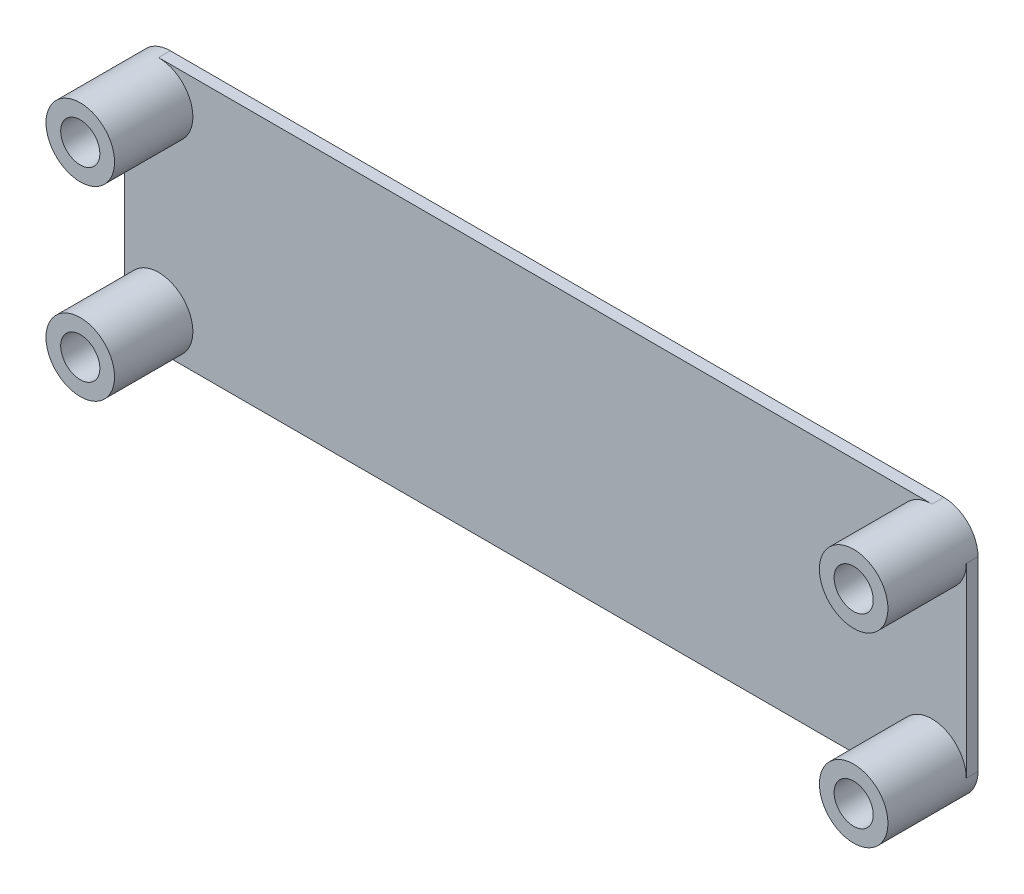
ISO-10303-21;
HEADER;
FILE_DESCRIPTION(('STEP AP214'),'2;1');
FILE_NAME('part.step','',(''),(''),'','','');
FILE_SCHEMA(('AUTOMOTIVE_DESIGN { 1 0 10303 214 1 1 1 1 }'));
ENDSEC;
DATA;
#1=APPLICATION_CONTEXT('core data for automotive mechanical design processes');
#2=APPLICATION_PROTOCOL_DEFINITION('international standard','automotive_design',2000,#1);
#3=PRODUCT_CONTEXT('',#1,'mechanical');
#4=PRODUCT('Part','Part','',(#3));
#5=PRODUCT_RELATED_PRODUCT_CATEGORY('part','',(#4));
#6=PRODUCT_DEFINITION_FORMATION('','',#4);
#7=PRODUCT_DEFINITION_CONTEXT('part definition',#1,'design');
#8=PRODUCT_DEFINITION('design','',#6,#7);
#9=PRODUCT_DEFINITION_SHAPE('','',#8);
#10=(LENGTH_UNIT() NAMED_UNIT(*) SI_UNIT(.MILLI.,.METRE.));
#11=(NAMED_UNIT(*) PLANE_ANGLE_UNIT() SI_UNIT($,.RADIAN.));
#12=(NAMED_UNIT(*) SI_UNIT($,.STERADIAN.) SOLID_ANGLE_UNIT());
#13=UNCERTAINTY_MEASURE_WITH_UNIT(LENGTH_MEASURE(1.E-05),#10,'distance_accuracy_value','');
#14=(GEOMETRIC_REPRESENTATION_CONTEXT(3) GLOBAL_UNCERTAINTY_ASSIGNED_CONTEXT((#13)) GLOBAL_UNIT_ASSIGNED_CONTEXT((#10,
#11,#12)) REPRESENTATION_CONTEXT('',''));
#15=CARTESIAN_POINT('',(0.,0.,0.));
#16=DIRECTION('',(0.,0.,1.));
#17=DIRECTION('',(1.,0.,0.));
#18=AXIS2_PLACEMENT_3D('',#15,#16,#17);
#19=CARTESIAN_POINT('',(0.,0.,1.2));
#20=DIRECTION('',(0.,0.,1.));
#21=DIRECTION('',(1.,0.,0.));
#22=AXIS2_PLACEMENT_3D('',#19,#20,#21);
#23=PLANE('',#22);
#24=DIRECTION('',(1.,0.,0.));
#25=VECTOR('',#24,1.);
#26=CARTESIAN_POINT('',(0.,0.,1.2));
#27=LINE('',#26,#25);
#28=CARTESIAN_POINT('',(3.5,0.,1.2));
#29=VERTEX_POINT('',#28);
#30=CARTESIAN_POINT('',(82.5,0.,1.2));
#31=VERTEX_POINT('',#30);
#32=EDGE_CURVE('E123',#29,#31,#27,.T.);
#33=ORIENTED_EDGE('',*,*,#32,.T.);
#34=CARTESIAN_POINT('',(82.5,3.5,1.2));
#35=DIRECTION('',(0.,0.,1.));
#36=DIRECTION('',(1.,0.,0.));
#37=AXIS2_PLACEMENT_3D('',#34,#35,#36);
#38=CIRCLE('',#37,3.50000000000001);
#39=CARTESIAN_POINT('',(86.,3.5,1.2));
#40=VERTEX_POINT('',#39);
#41=EDGE_CURVE('E130',#40,#31,#38,.T.);
#42=ORIENTED_EDGE('',*,*,#41,.F.);
#43=DIRECTION('',(0.,1.,0.));
#44=VECTOR('',#43,1.);
#45=CARTESIAN_POINT('',(86.,0.,1.2));
#46=LINE('',#45,#44);
#47=CARTESIAN_POINT('',(86.,22.5,1.2));
#48=VERTEX_POINT('',#47);
#49=EDGE_CURVE('E112',#40,#48,#46,.T.);
#50=ORIENTED_EDGE('',*,*,#49,.T.);
#51=CARTESIAN_POINT('',(82.5,22.5,1.2));
#52=DIRECTION('',(0.,0.,1.));
#53=DIRECTION('',(1.,0.,0.));
#54=AXIS2_PLACEMENT_3D('',#51,#52,#53);
#55=CIRCLE('',#54,3.50000000000001);
#56=CARTESIAN_POINT('',(82.5,26.,1.2));
#57=VERTEX_POINT('',#56);
#58=EDGE_CURVE('E11',#48,#57,#55,.F.);
#59=ORIENTED_EDGE('',*,*,#58,.T.);
#60=DIRECTION('',(1.,0.,0.));
#61=VECTOR('',#60,1.);
#62=CARTESIAN_POINT('',(0.,26.,1.2));
#63=LINE('',#62,#61);
#64=CARTESIAN_POINT('',(3.5,26.,1.2));
#65=VERTEX_POINT('',#64);
#66=EDGE_CURVE('E122',#65,#57,#63,.T.);
#67=ORIENTED_EDGE('',*,*,#66,.F.);
#68=CARTESIAN_POINT('',(3.5,22.5,1.2));
#69=DIRECTION('',(0.,0.,1.));
#70=DIRECTION('',(1.,0.,0.));
#71=AXIS2_PLACEMENT_3D('',#68,#69,#70);
#72=CIRCLE('',#71,3.5);
#73=CARTESIAN_POINT('',(0.,22.5,1.2));
#74=VERTEX_POINT('',#73);
#75=EDGE_CURVE('E57',#74,#65,#72,.T.);
#76=ORIENTED_EDGE('',*,*,#75,.F.);
#77=DIRECTION('',(0.,1.,0.));
#78=VECTOR('',#77,1.);
#79=CARTESIAN_POINT('',(0.,0.,1.2));
#80=LINE('',#79,#78);
#81=CARTESIAN_POINT('',(0.,3.5,1.2));
#82=VERTEX_POINT('',#81);
#83=EDGE_CURVE('E165',#82,#74,#80,.T.);
#84=ORIENTED_EDGE('',*,*,#83,.F.);
#85=CARTESIAN_POINT('',(3.5,3.5,1.2));
#86=DIRECTION('',(0.,0.,1.));
#87=DIRECTION('',(1.,0.,0.));
#88=AXIS2_PLACEMENT_3D('',#85,#86,#87);
#89=CIRCLE('',#88,3.5);
#90=EDGE_CURVE('E49',#82,#29,#89,.F.);
#91=ORIENTED_EDGE('',*,*,#90,.T.);
#92=EDGE_LOOP('',(#33,#42,#50,#59,#67,#76,#84,#91));
#93=FACE_BOUND('',#92,.T.);
#94=ADVANCED_FACE('F39',(#93),#23,.T.);
#95=CARTESIAN_POINT('',(0.,0.,1.2));
#96=DIRECTION('',(-1.,0.,0.));
#97=DIRECTION('',(0.,0.,1.));
#98=AXIS2_PLACEMENT_3D('',#95,#96,#97);
#99=PLANE('',#98);
#100=DIRECTION('',(0.,1.,0.));
#101=VECTOR('',#100,1.);
#102=CARTESIAN_POINT('',(0.,0.,0.));
#103=LINE('',#102,#101);
#104=CARTESIAN_POINT('',(0.,3.5,0.));
#105=VERTEX_POINT('',#104);
#106=CARTESIAN_POINT('',(0.,22.5,0.));
#107=VERTEX_POINT('',#106);
#108=EDGE_CURVE('E161',#105,#107,#103,.T.);
#109=ORIENTED_EDGE('',*,*,#108,.F.);
#110=DIRECTION('',(0.,0.,-1.));
#111=VECTOR('',#110,1.);
#112=CARTESIAN_POINT('',(0.,3.5,1.2));
#113=LINE('',#112,#111);
#114=EDGE_CURVE('E164',#82,#105,#113,.T.);
#115=ORIENTED_EDGE('',*,*,#114,.F.);
#116=ORIENTED_EDGE('',*,*,#83,.T.);
#117=DIRECTION('',(0.,0.,-1.));
#118=VECTOR('',#117,1.);
#119=CARTESIAN_POINT('',(0.,22.5,1.2));
#120=LINE('',#119,#118);
#121=EDGE_CURVE('E94',#74,#107,#120,.T.);
#122=ORIENTED_EDGE('',*,*,#121,.T.);
#123=EDGE_LOOP('',(#109,#115,#116,#122));
#124=FACE_BOUND('',#123,.T.);
#125=ADVANCED_FACE('F41',(#124),#99,.T.);
#126=CARTESIAN_POINT('',(3.5,3.5,1.2));
#127=DIRECTION('',(0.,0.,-1.));
#128=DIRECTION('',(-1.,0.,0.));
#129=AXIS2_PLACEMENT_3D('',#126,#127,#128);
#130=CYLINDRICAL_SURFACE('',#129,3.5);
#131=CARTESIAN_POINT('',(3.5,3.5,0.));
#132=DIRECTION('',(0.,0.,1.));
#133=DIRECTION('',(1.,0.,0.));
#134=AXIS2_PLACEMENT_3D('',#131,#132,#133);
#135=CIRCLE('',#134,3.5);
#136=CARTESIAN_POINT('',(3.5,0.,0.));
#137=VERTEX_POINT('',#136);
#138=EDGE_CURVE('E176',#105,#137,#135,.T.);
#139=ORIENTED_EDGE('',*,*,#138,.T.);
#140=DIRECTION('',(0.,0.,-1.));
#141=VECTOR('',#140,1.);
#142=CARTESIAN_POINT('',(3.5,0.,1.2));
#143=LINE('',#142,#141);
#144=EDGE_CURVE('E208',#29,#137,#143,.T.);
#145=ORIENTED_EDGE('',*,*,#144,.F.);
#146=ORIENTED_EDGE('',*,*,#90,.F.);
#147=ORIENTED_EDGE('',*,*,#114,.T.);
#148=EDGE_LOOP('',(#139,#145,#146,#147));
#149=FACE_BOUND('',#148,.T.);
#150=CARTESIAN_POINT('',(3.5,3.5,9.2));
#151=DIRECTION('',(0.,0.,1.));
#152=DIRECTION('',(1.,0.,0.));
#153=AXIS2_PLACEMENT_3D('',#150,#151,#152);
#154=CIRCLE('',#153,3.5);
#155=CARTESIAN_POINT('',(6.99999999999999,3.5,9.2));
#156=VERTEX_POINT('',#155);
#157=EDGE_CURVE('E145',#156,#156,#154,.T.);
#158=ORIENTED_EDGE('',*,*,#157,.F.);
#159=EDGE_LOOP('',(#158));
#160=FACE_BOUND('',#159,.T.);
#161=ADVANCED_FACE('F217',(#149,#160),#130,.T.);
#162=CARTESIAN_POINT('',(0.,0.,1.2));
#163=DIRECTION('',(0.,1.,0.));
#164=DIRECTION('',(0.,0.,1.));
#165=AXIS2_PLACEMENT_3D('',#162,#163,#164);
#166=PLANE('',#165);
#167=DIRECTION('',(1.,0.,0.));
#168=VECTOR('',#167,1.);
#169=CARTESIAN_POINT('',(0.,0.,0.));
#170=LINE('',#169,#168);
#171=CARTESIAN_POINT('',(82.5,0.,0.));
#172=VERTEX_POINT('',#171);
#173=EDGE_CURVE('E179',#137,#172,#170,.T.);
#174=ORIENTED_EDGE('',*,*,#173,.T.);
#175=DIRECTION('',(0.,0.,-1.));
#176=VECTOR('',#175,1.);
#177=CARTESIAN_POINT('',(82.5,0.,1.2));
#178=LINE('',#177,#176);
#179=EDGE_CURVE('E134',#31,#172,#178,.T.);
#180=ORIENTED_EDGE('',*,*,#179,.F.);
#181=ORIENTED_EDGE('',*,*,#32,.F.);
#182=ORIENTED_EDGE('',*,*,#144,.T.);
#183=EDGE_LOOP('',(#174,#180,#181,#182));
#184=FACE_BOUND('',#183,.T.);
#185=ADVANCED_FACE('F227',(#184),#166,.F.);
#186=CARTESIAN_POINT('',(82.5,3.5,1.2));
#187=DIRECTION('',(0.,0.,-1.));
#188=DIRECTION('',(-1.,0.,0.));
#189=AXIS2_PLACEMENT_3D('',#186,#187,#188);
#190=CYLINDRICAL_SURFACE('',#189,3.50000000000001);
#191=CARTESIAN_POINT('',(82.5,3.5,0.));
#192=DIRECTION('',(0.,0.,1.));
#193=DIRECTION('',(1.,0.,0.));
#194=AXIS2_PLACEMENT_3D('',#191,#192,#193);
#195=CIRCLE('',#194,3.50000000000001);
#196=CARTESIAN_POINT('',(86.,3.5,0.));
#197=VERTEX_POINT('',#196);
#198=EDGE_CURVE('E132',#172,#197,#195,.T.);
#199=ORIENTED_EDGE('',*,*,#198,.T.);
#200=DIRECTION('',(0.,0.,-1.));
#201=VECTOR('',#200,1.);
#202=CARTESIAN_POINT('',(86.,3.5,1.2));
#203=LINE('',#202,#201);
#204=EDGE_CURVE('E115',#40,#197,#203,.T.);
#205=ORIENTED_EDGE('',*,*,#204,.F.);
#206=ORIENTED_EDGE('',*,*,#41,.T.);
#207=ORIENTED_EDGE('',*,*,#179,.T.);
#208=EDGE_LOOP('',(#199,#205,#206,#207));
#209=FACE_BOUND('',#208,.T.);
#210=CARTESIAN_POINT('',(82.5,3.5,9.2));
#211=DIRECTION('',(0.,0.,1.));
#212=DIRECTION('',(1.,0.,0.));
#213=AXIS2_PLACEMENT_3D('',#210,#211,#212);
#214=CIRCLE('',#213,3.50000000000001);
#215=CARTESIAN_POINT('',(86.,3.5,9.2));
#216=VERTEX_POINT('',#215);
#217=EDGE_CURVE('E140',#216,#216,#214,.T.);
#218=ORIENTED_EDGE('',*,*,#217,.F.);
#219=EDGE_LOOP('',(#218));
#220=FACE_BOUND('',#219,.T.);
#221=ADVANCED_FACE('F127',(#209,#220),#190,.T.);
#222=CARTESIAN_POINT('',(86.,0.,1.2));
#223=DIRECTION('',(-1.,0.,0.));
#224=DIRECTION('',(0.,0.,1.));
#225=AXIS2_PLACEMENT_3D('',#222,#223,#224);
#226=PLANE('',#225);
#227=DIRECTION('',(0.,1.,0.));
#228=VECTOR('',#227,1.);
#229=CARTESIAN_POINT('',(86.,0.,0.));
#230=LINE('',#229,#228);
#231=CARTESIAN_POINT('',(86.,22.5,0.));
#232=VERTEX_POINT('',#231);
#233=EDGE_CURVE('E184',#197,#232,#230,.T.);
#234=ORIENTED_EDGE('',*,*,#233,.T.);
#235=DIRECTION('',(0.,0.,-1.));
#236=VECTOR('',#235,1.);
#237=CARTESIAN_POINT('',(86.,22.5,1.2));
#238=LINE('',#237,#236);
#239=EDGE_CURVE('E118',#48,#232,#238,.T.);
#240=ORIENTED_EDGE('',*,*,#239,.F.);
#241=ORIENTED_EDGE('',*,*,#49,.F.);
#242=ORIENTED_EDGE('',*,*,#204,.T.);
#243=EDGE_LOOP('',(#234,#240,#241,#242));
#244=FACE_BOUND('',#243,.T.);
#245=ADVANCED_FACE('F114',(#244),#226,.F.);
#246=CARTESIAN_POINT('',(82.5,22.5,1.2));
#247=DIRECTION('',(0.,0.,-1.));
#248=DIRECTION('',(-1.,0.,0.));
#249=AXIS2_PLACEMENT_3D('',#246,#247,#248);
#250=CYLINDRICAL_SURFACE('',#249,3.50000000000001);
#251=CARTESIAN_POINT('',(82.5,22.5,0.));
#252=DIRECTION('',(0.,0.,1.));
#253=DIRECTION('',(1.,0.,0.));
#254=AXIS2_PLACEMENT_3D('',#251,#252,#253);
#255=CIRCLE('',#254,3.50000000000001);
#256=CARTESIAN_POINT('',(82.5,26.,0.));
#257=VERTEX_POINT('',#256);
#258=EDGE_CURVE('E187',#232,#257,#255,.T.);
#259=ORIENTED_EDGE('',*,*,#258,.T.);
#260=DIRECTION('',(0.,0.,-1.));
#261=VECTOR('',#260,1.);
#262=CARTESIAN_POINT('',(82.5,26.,1.2));
#263=LINE('',#262,#261);
#264=EDGE_CURVE('E201',#57,#257,#263,.T.);
#265=ORIENTED_EDGE('',*,*,#264,.F.);
#266=ORIENTED_EDGE('',*,*,#58,.F.);
#267=ORIENTED_EDGE('',*,*,#239,.T.);
#268=EDGE_LOOP('',(#259,#265,#266,#267));
#269=FACE_BOUND('',#268,.T.);
#270=CARTESIAN_POINT('',(82.5,22.5,9.2));
#271=DIRECTION('',(0.,0.,1.));
#272=DIRECTION('',(1.,0.,0.));
#273=AXIS2_PLACEMENT_3D('',#270,#271,#272);
#274=CIRCLE('',#273,3.50000000000001);
#275=CARTESIAN_POINT('',(86.,22.5,9.2));
#276=VERTEX_POINT('',#275);
#277=EDGE_CURVE('E139',#276,#276,#274,.T.);
#278=ORIENTED_EDGE('',*,*,#277,.F.);
#279=EDGE_LOOP('',(#278));
#280=FACE_BOUND('',#279,.T.);
#281=ADVANCED_FACE('F243',(#269,#280),#250,.T.);
#282=CARTESIAN_POINT('',(0.,26.,1.2));
#283=DIRECTION('',(0.,1.,0.));
#284=DIRECTION('',(0.,0.,1.));
#285=AXIS2_PLACEMENT_3D('',#282,#283,#284);
#286=PLANE('',#285);
#287=DIRECTION('',(1.,0.,0.));
#288=VECTOR('',#287,1.);
#289=CARTESIAN_POINT('',(0.,26.,0.));
#290=LINE('',#289,#288);
#291=CARTESIAN_POINT('',(3.5,26.,0.));
#292=VERTEX_POINT('',#291);
#293=EDGE_CURVE('E191',#292,#257,#290,.T.);
#294=ORIENTED_EDGE('',*,*,#293,.F.);
#295=DIRECTION('',(0.,0.,-1.));
#296=VECTOR('',#295,1.);
#297=CARTESIAN_POINT('',(3.5,26.,1.2));
#298=LINE('',#297,#296);
#299=EDGE_CURVE('E87',#65,#292,#298,.T.);
#300=ORIENTED_EDGE('',*,*,#299,.F.);
#301=ORIENTED_EDGE('',*,*,#66,.T.);
#302=ORIENTED_EDGE('',*,*,#264,.T.);
#303=EDGE_LOOP('',(#294,#300,#301,#302));
#304=FACE_BOUND('',#303,.T.);
#305=ADVANCED_FACE('F240',(#304),#286,.T.);
#306=CARTESIAN_POINT('',(3.5,22.5,1.2));
#307=DIRECTION('',(0.,0.,-1.));
#308=DIRECTION('',(-1.,0.,0.));
#309=AXIS2_PLACEMENT_3D('',#306,#307,#308);
#310=CYLINDRICAL_SURFACE('',#309,3.5);
#311=CARTESIAN_POINT('',(3.5,22.5,0.));
#312=DIRECTION('',(0.,0.,1.));
#313=DIRECTION('',(1.,0.,0.));
#314=AXIS2_PLACEMENT_3D('',#311,#312,#313);
#315=CIRCLE('',#314,3.5);
#316=EDGE_CURVE('E168',#292,#107,#315,.T.);
#317=ORIENTED_EDGE('',*,*,#316,.T.);
#318=ORIENTED_EDGE('',*,*,#121,.F.);
#319=ORIENTED_EDGE('',*,*,#75,.T.);
#320=ORIENTED_EDGE('',*,*,#299,.T.);
#321=EDGE_LOOP('',(#317,#318,#319,#320));
#322=FACE_BOUND('',#321,.T.);
#323=CARTESIAN_POINT('',(3.5,22.5,9.2));
#324=DIRECTION('',(0.,0.,1.));
#325=DIRECTION('',(1.,0.,0.));
#326=AXIS2_PLACEMENT_3D('',#323,#324,#325);
#327=CIRCLE('',#326,3.5);
#328=CARTESIAN_POINT('',(7.,22.5,9.2));
#329=VERTEX_POINT('',#328);
#330=EDGE_CURVE('E157',#329,#329,#327,.T.);
#331=ORIENTED_EDGE('',*,*,#330,.F.);
#332=EDGE_LOOP('',(#331));
#333=FACE_BOUND('',#332,.T.);
#334=ADVANCED_FACE('F237',(#322,#333),#310,.T.);
#335=CARTESIAN_POINT('',(0.,0.,0.));
#336=DIRECTION('',(0.,0.,1.));
#337=DIRECTION('',(1.,0.,0.));
#338=AXIS2_PLACEMENT_3D('',#335,#336,#337);
#339=PLANE('',#338);
#340=ORIENTED_EDGE('',*,*,#108,.T.);
#341=ORIENTED_EDGE('',*,*,#316,.F.);
#342=ORIENTED_EDGE('',*,*,#293,.T.);
#343=ORIENTED_EDGE('',*,*,#258,.F.);
#344=ORIENTED_EDGE('',*,*,#233,.F.);
#345=ORIENTED_EDGE('',*,*,#198,.F.);
#346=ORIENTED_EDGE('',*,*,#173,.F.);
#347=ORIENTED_EDGE('',*,*,#138,.F.);
#348=EDGE_LOOP('',(#340,#341,#342,#343,#344,#345,#346,#347));
#349=FACE_BOUND('',#348,.T.);
#350=ADVANCED_FACE('F221',(#349),#339,.F.);
#351=CARTESIAN_POINT('',(3.5,22.5,9.2));
#352=DIRECTION('',(0.,0.,1.));
#353=DIRECTION('',(1.,0.,0.));
#354=AXIS2_PLACEMENT_3D('',#351,#352,#353);
#355=PLANE('',#354);
#356=CARTESIAN_POINT('',(3.5,22.5,9.2));
#357=DIRECTION('',(0.,0.,1.));
#358=DIRECTION('',(1.,0.,0.));
#359=AXIS2_PLACEMENT_3D('',#356,#357,#358);
#360=CIRCLE('',#359,2.);
#361=CARTESIAN_POINT('',(5.5,22.5,9.2));
#362=VERTEX_POINT('',#361);
#363=EDGE_CURVE('E151',#362,#362,#360,.T.);
#364=ORIENTED_EDGE('',*,*,#363,.F.);
#365=EDGE_LOOP('',(#364));
#366=FACE_BOUND('',#365,.T.);
#367=ORIENTED_EDGE('',*,*,#330,.T.);
#368=EDGE_LOOP('',(#367));
#369=FACE_BOUND('',#368,.T.);
#370=ADVANCED_FACE('F233',(#366,#369),#355,.T.);
#371=CARTESIAN_POINT('',(3.5,3.5,9.2));
#372=DIRECTION('',(0.,0.,1.));
#373=DIRECTION('',(1.,0.,0.));
#374=AXIS2_PLACEMENT_3D('',#371,#372,#373);
#375=PLANE('',#374);
#376=CARTESIAN_POINT('',(3.5,3.5,9.2));
#377=DIRECTION('',(0.,0.,1.));
#378=DIRECTION('',(1.,0.,0.));
#379=AXIS2_PLACEMENT_3D('',#376,#377,#378);
#380=CIRCLE('',#379,2.);
#381=CARTESIAN_POINT('',(5.5,3.5,9.2));
#382=VERTEX_POINT('',#381);
#383=EDGE_CURVE('E280',#382,#382,#380,.T.);
#384=ORIENTED_EDGE('',*,*,#383,.F.);
#385=EDGE_LOOP('',(#384));
#386=FACE_BOUND('',#385,.T.);
#387=ORIENTED_EDGE('',*,*,#157,.T.);
#388=EDGE_LOOP('',(#387));
#389=FACE_BOUND('',#388,.T.);
#390=ADVANCED_FACE('F264',(#386,#389),#375,.T.);
#391=CARTESIAN_POINT('',(82.5,22.5,9.2));
#392=DIRECTION('',(0.,0.,1.));
#393=DIRECTION('',(1.,0.,0.));
#394=AXIS2_PLACEMENT_3D('',#391,#392,#393);
#395=PLANE('',#394);
#396=CARTESIAN_POINT('',(82.5,22.5,9.2));
#397=DIRECTION('',(0.,0.,1.));
#398=DIRECTION('',(1.,0.,0.));
#399=AXIS2_PLACEMENT_3D('',#396,#397,#398);
#400=CIRCLE('',#399,2.);
#401=CARTESIAN_POINT('',(84.5,22.5,9.2));
#402=VERTEX_POINT('',#401);
#403=EDGE_CURVE('E295',#402,#402,#400,.T.);
#404=ORIENTED_EDGE('',*,*,#403,.F.);
#405=EDGE_LOOP('',(#404));
#406=FACE_BOUND('',#405,.T.);
#407=ORIENTED_EDGE('',*,*,#277,.T.);
#408=EDGE_LOOP('',(#407));
#409=FACE_BOUND('',#408,.T.);
#410=ADVANCED_FACE('F269',(#406,#409),#395,.T.);
#411=CARTESIAN_POINT('',(82.5,3.5,9.2));
#412=DIRECTION('',(0.,0.,1.));
#413=DIRECTION('',(1.,0.,0.));
#414=AXIS2_PLACEMENT_3D('',#411,#412,#413);
#415=PLANE('',#414);
#416=CARTESIAN_POINT('',(82.5,3.5,9.2));
#417=DIRECTION('',(0.,0.,1.));
#418=DIRECTION('',(1.,0.,0.));
#419=AXIS2_PLACEMENT_3D('',#416,#417,#418);
#420=CIRCLE('',#419,2.);
#421=CARTESIAN_POINT('',(84.5,3.5,9.2));
#422=VERTEX_POINT('',#421);
#423=EDGE_CURVE('E289',#422,#422,#420,.T.);
#424=ORIENTED_EDGE('',*,*,#423,.F.);
#425=EDGE_LOOP('',(#424));
#426=FACE_BOUND('',#425,.T.);
#427=ORIENTED_EDGE('',*,*,#217,.T.);
#428=EDGE_LOOP('',(#427));
#429=FACE_BOUND('',#428,.T.);
#430=ADVANCED_FACE('F311',(#426,#429),#415,.T.);
#431=CARTESIAN_POINT('',(82.5,3.5,3.2));
#432=DIRECTION('',(0.,0.,1.));
#433=DIRECTION('',(1.,0.,0.));
#434=AXIS2_PLACEMENT_3D('',#431,#432,#433);
#435=CYLINDRICAL_SURFACE('',#434,2.);
#436=CARTESIAN_POINT('',(82.5,3.5,3.2));
#437=DIRECTION('',(0.,0.,1.));
#438=DIRECTION('',(1.,0.,0.));
#439=AXIS2_PLACEMENT_3D('',#436,#437,#438);
#440=CIRCLE('',#439,2.);
#441=CARTESIAN_POINT('',(84.5,3.5,3.2));
#442=VERTEX_POINT('',#441);
#443=EDGE_CURVE('E298',#442,#442,#440,.T.);
#444=ORIENTED_EDGE('',*,*,#443,.F.);
#445=EDGE_LOOP('',(#444));
#446=FACE_BOUND('',#445,.T.);
#447=ORIENTED_EDGE('',*,*,#423,.T.);
#448=EDGE_LOOP('',(#447));
#449=FACE_BOUND('',#448,.T.);
#450=ADVANCED_FACE('F309',(#446,#449),#435,.F.);
#451=CARTESIAN_POINT('',(82.5,3.5,3.2));
#452=DIRECTION('',(0.,0.,1.));
#453=DIRECTION('',(1.,0.,0.));
#454=AXIS2_PLACEMENT_3D('',#451,#452,#453);
#455=PLANE('',#454);
#456=ORIENTED_EDGE('',*,*,#443,.T.);
#457=EDGE_LOOP('',(#456));
#458=FACE_BOUND('',#457,.T.);
#459=ADVANCED_FACE('F320',(#458),#455,.T.);
#460=CARTESIAN_POINT('',(82.5,22.5,3.2));
#461=DIRECTION('',(0.,0.,1.));
#462=DIRECTION('',(1.,0.,0.));
#463=AXIS2_PLACEMENT_3D('',#460,#461,#462);
#464=CYLINDRICAL_SURFACE('',#463,2.);
#465=CARTESIAN_POINT('',(82.5,22.5,3.2));
#466=DIRECTION('',(0.,0.,1.));
#467=DIRECTION('',(1.,0.,0.));
#468=AXIS2_PLACEMENT_3D('',#465,#466,#467);
#469=CIRCLE('',#468,2.);
#470=CARTESIAN_POINT('',(84.5,22.5,3.2));
#471=VERTEX_POINT('',#470);
#472=EDGE_CURVE('E286',#471,#471,#469,.T.);
#473=ORIENTED_EDGE('',*,*,#472,.F.);
#474=EDGE_LOOP('',(#473));
#475=FACE_BOUND('',#474,.T.);
#476=ORIENTED_EDGE('',*,*,#403,.T.);
#477=EDGE_LOOP('',(#476));
#478=FACE_BOUND('',#477,.T.);
#479=ADVANCED_FACE('F335',(#475,#478),#464,.F.);
#480=CARTESIAN_POINT('',(82.5,22.5,3.2));
#481=DIRECTION('',(0.,0.,1.));
#482=DIRECTION('',(1.,0.,0.));
#483=AXIS2_PLACEMENT_3D('',#480,#481,#482);
#484=PLANE('',#483);
#485=ORIENTED_EDGE('',*,*,#472,.T.);
#486=EDGE_LOOP('',(#485));
#487=FACE_BOUND('',#486,.T.);
#488=ADVANCED_FACE('F338',(#487),#484,.T.);
#489=CARTESIAN_POINT('',(3.5,3.5,3.2));
#490=DIRECTION('',(0.,0.,1.));
#491=DIRECTION('',(1.,0.,0.));
#492=AXIS2_PLACEMENT_3D('',#489,#490,#491);
#493=CYLINDRICAL_SURFACE('',#492,2.);
#494=CARTESIAN_POINT('',(3.5,3.5,3.2));
#495=DIRECTION('',(0.,0.,1.));
#496=DIRECTION('',(1.,0.,0.));
#497=AXIS2_PLACEMENT_3D('',#494,#495,#496);
#498=CIRCLE('',#497,2.);
#499=CARTESIAN_POINT('',(5.5,3.5,3.2));
#500=VERTEX_POINT('',#499);
#501=EDGE_CURVE('E275',#500,#500,#498,.T.);
#502=ORIENTED_EDGE('',*,*,#501,.F.);
#503=EDGE_LOOP('',(#502));
#504=FACE_BOUND('',#503,.T.);
#505=ORIENTED_EDGE('',*,*,#383,.T.);
#506=EDGE_LOOP('',(#505));
#507=FACE_BOUND('',#506,.T.);
#508=ADVANCED_FACE('F342',(#504,#507),#493,.F.);
#509=CARTESIAN_POINT('',(3.5,3.5,3.2));
#510=DIRECTION('',(0.,0.,1.));
#511=DIRECTION('',(1.,0.,0.));
#512=AXIS2_PLACEMENT_3D('',#509,#510,#511);
#513=PLANE('',#512);
#514=ORIENTED_EDGE('',*,*,#501,.T.);
#515=EDGE_LOOP('',(#514));
#516=FACE_BOUND('',#515,.T.);
#517=ADVANCED_FACE('F330',(#516),#513,.T.);
#518=CARTESIAN_POINT('',(3.5,22.5,3.2));
#519=DIRECTION('',(0.,0.,1.));
#520=DIRECTION('',(1.,0.,0.));
#521=AXIS2_PLACEMENT_3D('',#518,#519,#520);
#522=CYLINDRICAL_SURFACE('',#521,2.);
#523=CARTESIAN_POINT('',(3.5,22.5,3.2));
#524=DIRECTION('',(0.,0.,1.));
#525=DIRECTION('',(1.,0.,0.));
#526=AXIS2_PLACEMENT_3D('',#523,#524,#525);
#527=CIRCLE('',#526,2.);
#528=CARTESIAN_POINT('',(5.5,22.5,3.2));
#529=VERTEX_POINT('',#528);
#530=EDGE_CURVE('E148',#529,#529,#527,.T.);
#531=ORIENTED_EDGE('',*,*,#530,.F.);
#532=EDGE_LOOP('',(#531));
#533=FACE_BOUND('',#532,.T.);
#534=ORIENTED_EDGE('',*,*,#363,.T.);
#535=EDGE_LOOP('',(#534));
#536=FACE_BOUND('',#535,.T.);
#537=ADVANCED_FACE('F326',(#533,#536),#522,.F.);
#538=CARTESIAN_POINT('',(3.5,22.5,3.2));
#539=DIRECTION('',(0.,0.,1.));
#540=DIRECTION('',(1.,0.,0.));
#541=AXIS2_PLACEMENT_3D('',#538,#539,#540);
#542=PLANE('',#541);
#543=ORIENTED_EDGE('',*,*,#530,.T.);
#544=EDGE_LOOP('',(#543));
#545=FACE_BOUND('',#544,.T.);
#546=ADVANCED_FACE('F329',(#545),#542,.T.);
#547=CLOSED_SHELL('',(#94,#125,#161,#185,#221,#245,#281,#305,#334,#350,#370,#390,#410,#430,#450,
#459,#479,#488,#508,#517,#537,#546));
#548=MANIFOLD_SOLID_BREP('B2',#547);
#549=ADVANCED_BREP_SHAPE_REPRESENTATION('',(#18,#548),#14);
#550=SHAPE_DEFINITION_REPRESENTATION(#9,#549);
ENDSEC;
END-ISO-10303-21;
